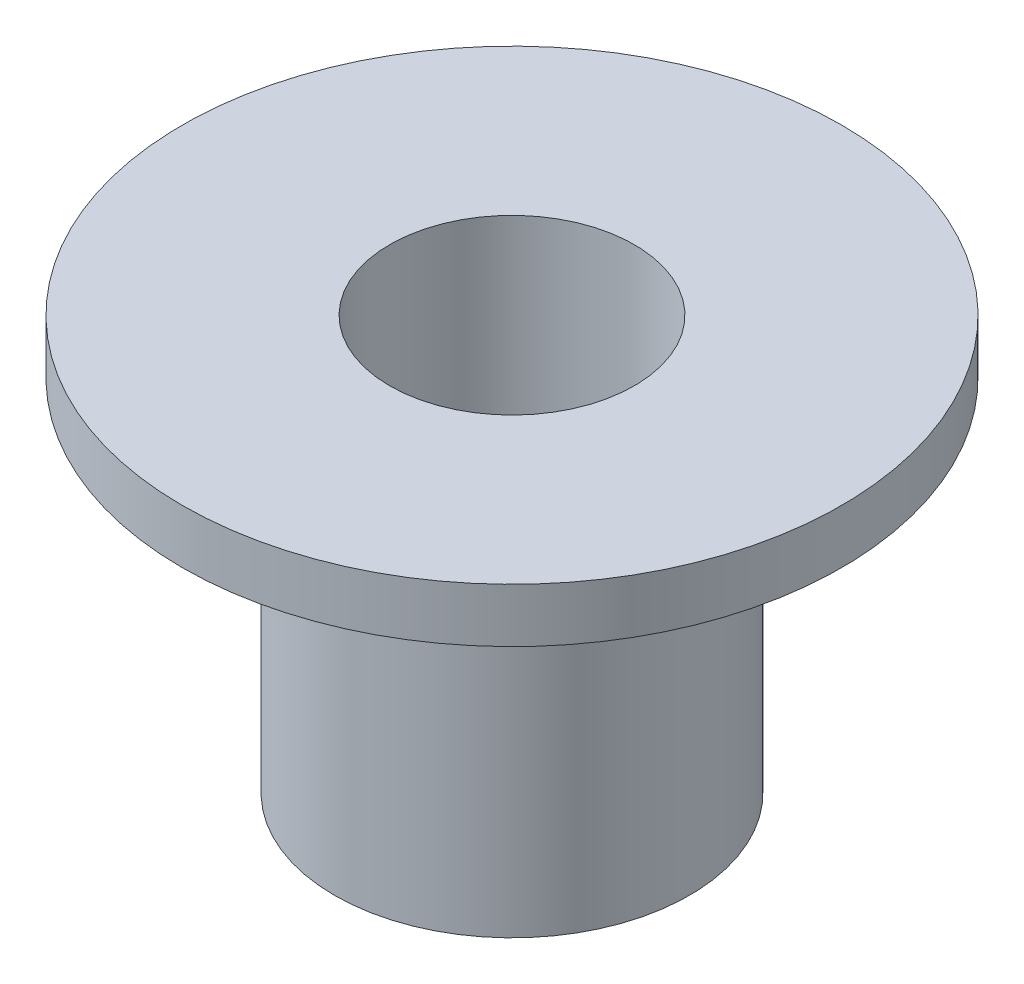
ISO-10303-21;
HEADER;
FILE_DESCRIPTION(('STEP AP214'),'2;1');
FILE_NAME('part.step','',(''),(''),'','','');
FILE_SCHEMA(('AUTOMOTIVE_DESIGN { 1 0 10303 214 1 1 1 1 }'));
ENDSEC;
DATA;
#1=APPLICATION_CONTEXT('core data for automotive mechanical design processes');
#2=APPLICATION_PROTOCOL_DEFINITION('international standard','automotive_design',2000,#1);
#3=PRODUCT_CONTEXT('',#1,'mechanical');
#4=PRODUCT('Part','Part','',(#3));
#5=PRODUCT_RELATED_PRODUCT_CATEGORY('part','',(#4));
#6=PRODUCT_DEFINITION_FORMATION('','',#4);
#7=PRODUCT_DEFINITION_CONTEXT('part definition',#1,'design');
#8=PRODUCT_DEFINITION('design','',#6,#7);
#9=PRODUCT_DEFINITION_SHAPE('','',#8);
#10=(LENGTH_UNIT() NAMED_UNIT(*) SI_UNIT(.MILLI.,.METRE.));
#11=(NAMED_UNIT(*) PLANE_ANGLE_UNIT() SI_UNIT($,.RADIAN.));
#12=(NAMED_UNIT(*) SI_UNIT($,.STERADIAN.) SOLID_ANGLE_UNIT());
#13=UNCERTAINTY_MEASURE_WITH_UNIT(LENGTH_MEASURE(1.E-05),#10,'distance_accuracy_value','');
#14=(GEOMETRIC_REPRESENTATION_CONTEXT(3) GLOBAL_UNCERTAINTY_ASSIGNED_CONTEXT((#13)) GLOBAL_UNIT_ASSIGNED_CONTEXT((#10,
#11,#12)) REPRESENTATION_CONTEXT('',''));
#15=CARTESIAN_POINT('',(0.,0.,0.));
#16=DIRECTION('',(0.,0.,1.));
#17=DIRECTION('',(1.,0.,0.));
#18=AXIS2_PLACEMENT_3D('',#15,#16,#17);
#19=CARTESIAN_POINT('',(0.,0.,0.));
#20=DIRECTION('',(0.,1.,0.));
#21=DIRECTION('',(0.,0.,1.));
#22=AXIS2_PLACEMENT_3D('',#19,#20,#21);
#23=CYLINDRICAL_SURFACE('',#22,3.39999999999999);
#24=CARTESIAN_POINT('',(0.,0.,0.));
#25=DIRECTION('',(0.,1.,0.));
#26=DIRECTION('',(0.,0.,1.));
#27=AXIS2_PLACEMENT_3D('',#24,#25,#26);
#28=CIRCLE('',#27,3.39999999999999);
#29=CARTESIAN_POINT('',(0.,0.,3.39999999999999));
#30=VERTEX_POINT('',#29);
#31=EDGE_CURVE('E10',#30,#30,#28,.T.);
#32=ORIENTED_EDGE('',*,*,#31,.T.);
#33=EDGE_LOOP('',(#32));
#34=FACE_BOUND('',#33,.T.);
#35=CARTESIAN_POINT('',(0.,-11.5000037998471,0.));
#36=DIRECTION('',(0.,1.,0.));
#37=DIRECTION('',(0.,0.,1.));
#38=AXIS2_PLACEMENT_3D('',#35,#36,#37);
#39=CIRCLE('',#38,3.4);
#40=CARTESIAN_POINT('',(0.,-11.5000037998471,3.4));
#41=VERTEX_POINT('',#40);
#42=EDGE_CURVE('E30',#41,#41,#39,.T.);
#43=ORIENTED_EDGE('',*,*,#42,.F.);
#44=EDGE_LOOP('',(#43));
#45=FACE_BOUND('',#44,.T.);
#46=ADVANCED_FACE('F14',(#34,#45),#23,.F.);
#47=CARTESIAN_POINT('',(0.,-15.3467923021334,0.));
#48=DIRECTION('',(0.,1.,0.));
#49=DIRECTION('',(0.,0.,1.));
#50=AXIS2_PLACEMENT_3D('',#47,#48,#49);
#51=CYLINDRICAL_SURFACE('',#50,4.93237459994922);
#52=CARTESIAN_POINT('',(0.,-1.50000459994903,0.));
#53=DIRECTION('',(0.,1.,0.));
#54=DIRECTION('',(0.,0.,1.));
#55=AXIS2_PLACEMENT_3D('',#52,#53,#54);
#56=CIRCLE('',#55,4.93237459994922);
#57=CARTESIAN_POINT('',(0.,-1.50000459994903,4.93237459994919));
#58=VERTEX_POINT('',#57);
#59=EDGE_CURVE('E32',#58,#58,#56,.T.);
#60=ORIENTED_EDGE('',*,*,#59,.F.);
#61=EDGE_LOOP('',(#60));
#62=FACE_BOUND('',#61,.T.);
#63=CARTESIAN_POINT('',(0.,-11.5000037998471,0.));
#64=DIRECTION('',(0.,1.,0.));
#65=DIRECTION('',(0.,0.,1.));
#66=AXIS2_PLACEMENT_3D('',#63,#64,#65);
#67=CIRCLE('',#66,4.93237459994922);
#68=CARTESIAN_POINT('',(0.,-11.5000037998471,4.93237459994919));
#69=VERTEX_POINT('',#68);
#70=EDGE_CURVE('E22',#69,#69,#67,.T.);
#71=ORIENTED_EDGE('',*,*,#70,.T.);
#72=EDGE_LOOP('',(#71));
#73=FACE_BOUND('',#72,.T.);
#74=ADVANCED_FACE('F50',(#62,#73),#51,.T.);
#75=CARTESIAN_POINT('',(0.,-15.3467923021334,0.));
#76=DIRECTION('',(0.,1.,0.));
#77=DIRECTION('',(0.,0.,1.));
#78=AXIS2_PLACEMENT_3D('',#75,#76,#77);
#79=CYLINDRICAL_SURFACE('',#78,9.16012425704849);
#80=CARTESIAN_POINT('',(0.,0.,0.));
#81=DIRECTION('',(0.,1.,0.));
#82=DIRECTION('',(0.,0.,1.));
#83=AXIS2_PLACEMENT_3D('',#80,#81,#82);
#84=CIRCLE('',#83,9.16012425704849);
#85=CARTESIAN_POINT('',(0.,0.,9.16012425704846));
#86=VERTEX_POINT('',#85);
#87=EDGE_CURVE('E18',#86,#86,#84,.T.);
#88=ORIENTED_EDGE('',*,*,#87,.F.);
#89=EDGE_LOOP('',(#88));
#90=FACE_BOUND('',#89,.T.);
#91=CARTESIAN_POINT('',(0.,-1.50000459994903,0.));
#92=DIRECTION('',(0.,1.,0.));
#93=DIRECTION('',(0.,0.,1.));
#94=AXIS2_PLACEMENT_3D('',#91,#92,#93);
#95=CIRCLE('',#94,9.16012425704849);
#96=CARTESIAN_POINT('',(0.,-1.50000459994903,9.16012425704846));
#97=VERTEX_POINT('',#96);
#98=EDGE_CURVE('E27',#97,#97,#95,.T.);
#99=ORIENTED_EDGE('',*,*,#98,.T.);
#100=EDGE_LOOP('',(#99));
#101=FACE_BOUND('',#100,.T.);
#102=ADVANCED_FACE('F37',(#90,#101),#79,.T.);
#103=CARTESIAN_POINT('',(9.16012425704849,-1.50000459994903,0.));
#104=DIRECTION('',(0.,-1.,0.));
#105=DIRECTION('',(0.,0.,-1.));
#106=AXIS2_PLACEMENT_3D('',#103,#104,#105);
#107=PLANE('',#106);
#108=ORIENTED_EDGE('',*,*,#59,.T.);
#109=EDGE_LOOP('',(#108));
#110=FACE_BOUND('',#109,.T.);
#111=ORIENTED_EDGE('',*,*,#98,.F.);
#112=EDGE_LOOP('',(#111));
#113=FACE_BOUND('',#112,.T.);
#114=ADVANCED_FACE('F39',(#110,#113),#107,.T.);
#115=CARTESIAN_POINT('',(0.,0.,0.));
#116=DIRECTION('',(0.,1.,0.));
#117=DIRECTION('',(0.,0.,1.));
#118=AXIS2_PLACEMENT_3D('',#115,#116,#117);
#119=PLANE('',#118);
#120=ORIENTED_EDGE('',*,*,#31,.F.);
#121=EDGE_LOOP('',(#120));
#122=FACE_BOUND('',#121,.T.);
#123=ORIENTED_EDGE('',*,*,#87,.T.);
#124=EDGE_LOOP('',(#123));
#125=FACE_BOUND('',#124,.T.);
#126=ADVANCED_FACE('F41',(#122,#125),#119,.T.);
#127=CARTESIAN_POINT('',(4.93237459994922,-11.500003799847,0.));
#128=DIRECTION('',(0.,-1.,0.));
#129=DIRECTION('',(0.,0.,-1.));
#130=AXIS2_PLACEMENT_3D('',#127,#128,#129);
#131=PLANE('',#130);
#132=ORIENTED_EDGE('',*,*,#42,.T.);
#133=EDGE_LOOP('',(#132));
#134=FACE_BOUND('',#133,.T.);
#135=ORIENTED_EDGE('',*,*,#70,.F.);
#136=EDGE_LOOP('',(#135));
#137=FACE_BOUND('',#136,.T.);
#138=ADVANCED_FACE('F16',(#134,#137),#131,.T.);
#139=CLOSED_SHELL('',(#46,#74,#102,#114,#126,#138));
#140=MANIFOLD_SOLID_BREP('B1',#139);
#141=ADVANCED_BREP_SHAPE_REPRESENTATION('',(#18,#140),#14);
#142=SHAPE_DEFINITION_REPRESENTATION(#9,#141);
ENDSEC;
END-ISO-10303-21;
